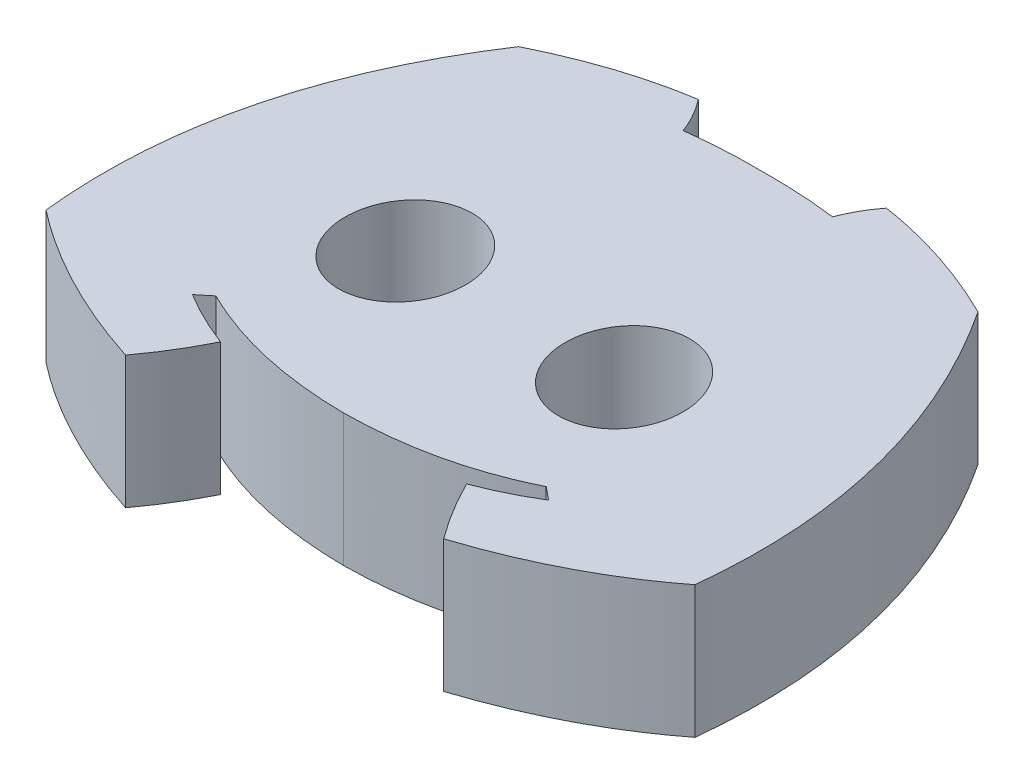
ISO-10303-21;
HEADER;
FILE_DESCRIPTION(('STEP AP214'),'2;1');
FILE_NAME('part.step','',(''),(''),'','','');
FILE_SCHEMA(('AUTOMOTIVE_DESIGN { 1 0 10303 214 1 1 1 1 }'));
ENDSEC;
DATA;
#1=APPLICATION_CONTEXT('core data for automotive mechanical design processes');
#2=APPLICATION_PROTOCOL_DEFINITION('international standard','automotive_design',2000,#1);
#3=PRODUCT_CONTEXT('',#1,'mechanical');
#4=PRODUCT('Part','Part','',(#3));
#5=PRODUCT_RELATED_PRODUCT_CATEGORY('part','',(#4));
#6=PRODUCT_DEFINITION_FORMATION('','',#4);
#7=PRODUCT_DEFINITION_CONTEXT('part definition',#1,'design');
#8=PRODUCT_DEFINITION('design','',#6,#7);
#9=PRODUCT_DEFINITION_SHAPE('','',#8);
#10=(LENGTH_UNIT() NAMED_UNIT(*) SI_UNIT(.MILLI.,.METRE.));
#11=(NAMED_UNIT(*) PLANE_ANGLE_UNIT() SI_UNIT($,.RADIAN.));
#12=(NAMED_UNIT(*) SI_UNIT($,.STERADIAN.) SOLID_ANGLE_UNIT());
#13=UNCERTAINTY_MEASURE_WITH_UNIT(LENGTH_MEASURE(1.E-05),#10,'distance_accuracy_value','');
#14=(GEOMETRIC_REPRESENTATION_CONTEXT(3) GLOBAL_UNCERTAINTY_ASSIGNED_CONTEXT((#13)) GLOBAL_UNIT_ASSIGNED_CONTEXT((#10,
#11,#12)) REPRESENTATION_CONTEXT('',''));
#15=CARTESIAN_POINT('',(0.,0.,0.));
#16=DIRECTION('',(0.,0.,1.));
#17=DIRECTION('',(1.,0.,0.));
#18=AXIS2_PLACEMENT_3D('',#15,#16,#17);
#19=CARTESIAN_POINT('',(8.0825305462773,2.,-2.02160904421695));
#20=CARTESIAN_POINT('',(6.66292776948715,2.,-2.02162384788936));
#21=CARTESIAN_POINT('',(5.52327282169725,2.,-2.58974505584235));
#22=B_SPLINE_CURVE_WITH_KNOTS('',2,(#19,#20,#21),.UNSPECIFIED.,.F.,.F.,(3,3),(0.,1.),.UNSPECIFIED.);
#23=DIRECTION('',(0.,-1.,0.));
#24=VECTOR('',#23,1.);
#25=SURFACE_OF_LINEAR_EXTRUSION('',#22,#24);
#26=CARTESIAN_POINT('',(8.0825305462773,0.,-2.02160904421695));
#27=CARTESIAN_POINT('',(6.66292776948715,0.,-2.02162384788936));
#28=CARTESIAN_POINT('',(5.52327282169725,0.,-2.58974505584235));
#29=B_SPLINE_CURVE_WITH_KNOTS('',2,(#26,#27,#28),.UNSPECIFIED.,.F.,.F.,(3,3),(0.,1.),.UNSPECIFIED.);
#30=CARTESIAN_POINT('',(8.02083951354053,0.,-2.02187905753027));
#31=VERTEX_POINT('',#30);
#32=CARTESIAN_POINT('',(5.52327282169725,0.,-2.58974505584235));
#33=VERTEX_POINT('',#32);
#34=EDGE_CURVE('E395',#31,#33,#29,.T.);
#35=ORIENTED_EDGE('',*,*,#34,.F.);
#36=DIRECTION('',(0.,-1.,0.));
#37=VECTOR('',#36,1.);
#38=CARTESIAN_POINT('',(8.02083951354053,2.,-2.02187905753027));
#39=LINE('',#38,#37);
#40=CARTESIAN_POINT('',(8.02083951354053,2.,-2.02187905753027));
#41=VERTEX_POINT('',#40);
#42=EDGE_CURVE('E11',#41,#31,#39,.T.);
#43=ORIENTED_EDGE('',*,*,#42,.F.);
#44=CARTESIAN_POINT('',(5.52327282169725,2.,-2.58974505584235));
#45=VERTEX_POINT('',#44);
#46=EDGE_CURVE('E360',#41,#45,#22,.T.);
#47=ORIENTED_EDGE('',*,*,#46,.T.);
#48=DIRECTION('',(0.,-1.,0.));
#49=VECTOR('',#48,1.);
#50=CARTESIAN_POINT('',(5.52327282169725,2.,-2.58974505584235));
#51=LINE('',#50,#49);
#52=EDGE_CURVE('E53',#45,#33,#51,.T.);
#53=ORIENTED_EDGE('',*,*,#52,.T.);
#54=EDGE_LOOP('',(#35,#43,#47,#53));
#55=FACE_BOUND('',#54,.T.);
#56=ADVANCED_FACE('F35',(#55),#25,.T.);
#57=CARTESIAN_POINT('',(7.95914845315265,2.,-2.02160904421695));
#58=CARTESIAN_POINT('',(9.3787512299428,2.,-2.02162384788936));
#59=CARTESIAN_POINT('',(10.5184061777327,2.,-2.58974505584235));
#60=B_SPLINE_CURVE_WITH_KNOTS('',2,(#57,#58,#59),.UNSPECIFIED.,.F.,.F.,(3,3),(0.,1.),.UNSPECIFIED.);
#61=DIRECTION('',(0.,-1.,0.));
#62=VECTOR('',#61,1.);
#63=SURFACE_OF_LINEAR_EXTRUSION('',#60,#62);
#64=CARTESIAN_POINT('',(7.95914845315265,0.,-2.02160904421695));
#65=CARTESIAN_POINT('',(9.3787512299428,0.,-2.02162384788936));
#66=CARTESIAN_POINT('',(10.5184061777327,0.,-2.58974505584235));
#67=B_SPLINE_CURVE_WITH_KNOTS('',2,(#64,#65,#66),.UNSPECIFIED.,.F.,.F.,(3,3),(0.,1.),.UNSPECIFIED.);
#68=CARTESIAN_POINT('',(10.5184061777327,0.,-2.58974505584235));
#69=VERTEX_POINT('',#68);
#70=EDGE_CURVE('E393',#31,#69,#67,.T.);
#71=ORIENTED_EDGE('',*,*,#70,.T.);
#72=DIRECTION('',(0.,-1.,0.));
#73=VECTOR('',#72,1.);
#74=CARTESIAN_POINT('',(10.5184061777327,2.,-2.58974505584235));
#75=LINE('',#74,#73);
#76=CARTESIAN_POINT('',(10.5184061777327,2.,-2.58974505584235));
#77=VERTEX_POINT('',#76);
#78=EDGE_CURVE('E45',#77,#69,#75,.T.);
#79=ORIENTED_EDGE('',*,*,#78,.F.);
#80=EDGE_CURVE('E354',#41,#77,#60,.T.);
#81=ORIENTED_EDGE('',*,*,#80,.F.);
#82=ORIENTED_EDGE('',*,*,#42,.T.);
#83=EDGE_LOOP('',(#71,#79,#81,#82));
#84=FACE_BOUND('',#83,.T.);
#85=ADVANCED_FACE('F347',(#84),#63,.F.);
#86=CARTESIAN_POINT('',(5.47717775319327,2.,-6.70674826921623));
#87=DIRECTION('',(0.632534570862425,0.,-0.774532127586641));
#88=DIRECTION('',(-0.774532127586641,0.,-0.632534570862425));
#89=AXIS2_PLACEMENT_3D('',#86,#87,#88);
#90=PLANE('',#89);
#91=DIRECTION('',(0.774532127586641,0.,0.632534570862425));
#92=VECTOR('',#91,1.);
#93=CARTESIAN_POINT('',(5.47717775319327,0.,-6.70674826921623));
#94=LINE('',#93,#92);
#95=CARTESIAN_POINT('',(10.714311063487,0.,-2.42975606580967));
#96=VERTEX_POINT('',#95);
#97=EDGE_CURVE('E391',#69,#96,#94,.T.);
#98=ORIENTED_EDGE('',*,*,#97,.T.);
#99=DIRECTION('',(0.,-1.,0.));
#100=VECTOR('',#99,1.);
#101=CARTESIAN_POINT('',(10.714311063487,2.,-2.42975606580967));
#102=LINE('',#101,#100);
#103=CARTESIAN_POINT('',(10.714311063487,2.,-2.42975606580967));
#104=VERTEX_POINT('',#103);
#105=EDGE_CURVE('E379',#104,#96,#102,.T.);
#106=ORIENTED_EDGE('',*,*,#105,.F.);
#107=DIRECTION('',(0.774532127586641,0.,0.632534570862425));
#108=VECTOR('',#107,1.);
#109=CARTESIAN_POINT('',(5.47717775319327,2.,-6.70674826921623));
#110=LINE('',#109,#108);
#111=EDGE_CURVE('E359',#77,#104,#110,.T.);
#112=ORIENTED_EDGE('',*,*,#111,.F.);
#113=ORIENTED_EDGE('',*,*,#78,.T.);
#114=EDGE_LOOP('',(#98,#106,#112,#113));
#115=FACE_BOUND('',#114,.T.);
#116=ADVANCED_FACE('F343',(#115),#90,.F.);
#117=CARTESIAN_POINT('',(10.714311063487,2.,-2.42975606580967));
#118=CARTESIAN_POINT('',(10.330675491839,2.,-2.19304475564389));
#119=CARTESIAN_POINT('',(9.88171529903122,2.,-2.02160904421695));
#120=B_SPLINE_CURVE_WITH_KNOTS('',2,(#117,#118,#119),.UNSPECIFIED.,.F.,.F.,(3,3),(0.,1.),.UNSPECIFIED.);
#121=DIRECTION('',(0.,-1.,0.));
#122=VECTOR('',#121,1.);
#123=SURFACE_OF_LINEAR_EXTRUSION('',#120,#122);
#124=CARTESIAN_POINT('',(10.714311063487,0.,-2.42975606580967));
#125=CARTESIAN_POINT('',(10.330675491839,0.,-2.19304475564389));
#126=CARTESIAN_POINT('',(9.88171529903122,0.,-2.02160904421695));
#127=B_SPLINE_CURVE_WITH_KNOTS('',2,(#124,#125,#126),.UNSPECIFIED.,.F.,.F.,(3,3),(0.,1.),.UNSPECIFIED.);
#128=CARTESIAN_POINT('',(9.88171529903122,0.,-2.02160904421695));
#129=VERTEX_POINT('',#128);
#130=EDGE_CURVE('E377',#96,#129,#127,.T.);
#131=ORIENTED_EDGE('',*,*,#130,.T.);
#132=DIRECTION('',(0.,-1.,0.));
#133=VECTOR('',#132,1.);
#134=CARTESIAN_POINT('',(9.88171529903122,2.,-2.02160904421695));
#135=LINE('',#134,#133);
#136=CARTESIAN_POINT('',(9.88171529903122,2.,-2.02160904421695));
#137=VERTEX_POINT('',#136);
#138=EDGE_CURVE('E376',#137,#129,#135,.T.);
#139=ORIENTED_EDGE('',*,*,#138,.F.);
#140=EDGE_CURVE('E328',#104,#137,#120,.T.);
#141=ORIENTED_EDGE('',*,*,#140,.F.);
#142=ORIENTED_EDGE('',*,*,#105,.T.);
#143=EDGE_LOOP('',(#131,#139,#141,#142));
#144=FACE_BOUND('',#143,.T.);
#145=ADVANCED_FACE('F339',(#144),#123,.F.);
#146=CARTESIAN_POINT('',(9.88171529903122,2.,-2.02160904421695));
#147=CARTESIAN_POINT('',(10.1225136518505,2.,-1.54002714216466));
#148=CARTESIAN_POINT('',(10.426983897714,2.,-1.1302536569728));
#149=B_SPLINE_CURVE_WITH_KNOTS('',2,(#146,#147,#148),.UNSPECIFIED.,.F.,.F.,(3,3),(0.,1.),.UNSPECIFIED.);
#150=DIRECTION('',(0.,-1.,0.));
#151=VECTOR('',#150,1.);
#152=SURFACE_OF_LINEAR_EXTRUSION('',#149,#151);
#153=CARTESIAN_POINT('',(9.88171529903122,0.,-2.02160904421695));
#154=CARTESIAN_POINT('',(10.1225136518505,0.,-1.54002714216466));
#155=CARTESIAN_POINT('',(10.426983897714,0.,-1.1302536569728));
#156=B_SPLINE_CURVE_WITH_KNOTS('',2,(#153,#154,#155),.UNSPECIFIED.,.F.,.F.,(3,3),(0.,1.),.UNSPECIFIED.);
#157=CARTESIAN_POINT('',(10.426983897714,0.,-1.1302536569728));
#158=VERTEX_POINT('',#157);
#159=EDGE_CURVE('E412',#129,#158,#156,.T.);
#160=ORIENTED_EDGE('',*,*,#159,.T.);
#161=DIRECTION('',(0.,-1.,0.));
#162=VECTOR('',#161,1.);
#163=CARTESIAN_POINT('',(10.426983897714,2.,-1.1302536569728));
#164=LINE('',#163,#162);
#165=CARTESIAN_POINT('',(10.426983897714,2.,-1.1302536569728));
#166=VERTEX_POINT('',#165);
#167=EDGE_CURVE('E380',#166,#158,#164,.T.);
#168=ORIENTED_EDGE('',*,*,#167,.F.);
#169=EDGE_CURVE('E319',#137,#166,#149,.T.);
#170=ORIENTED_EDGE('',*,*,#169,.F.);
#171=ORIENTED_EDGE('',*,*,#138,.T.);
#172=EDGE_LOOP('',(#160,#168,#170,#171));
#173=FACE_BOUND('',#172,.T.);
#174=ADVANCED_FACE('F336',(#173),#152,.F.);
#175=CARTESIAN_POINT('',(10.426983897714,2.,-1.1302536569728));
#176=CARTESIAN_POINT('',(11.8596175561387,2.,-1.59582996070251));
#177=CARTESIAN_POINT('',(12.9296249950977,2.,-2.42975606580967));
#178=B_SPLINE_CURVE_WITH_KNOTS('',2,(#175,#176,#177),.UNSPECIFIED.,.F.,.F.,(3,3),(0.,1.),.UNSPECIFIED.);
#179=DIRECTION('',(0.,-1.,0.));
#180=VECTOR('',#179,1.);
#181=SURFACE_OF_LINEAR_EXTRUSION('',#178,#180);
#182=CARTESIAN_POINT('',(10.426983897714,0.,-1.1302536569728));
#183=CARTESIAN_POINT('',(11.8596175561387,0.,-1.59582996070251));
#184=CARTESIAN_POINT('',(12.9296249950977,0.,-2.42975606580967));
#185=B_SPLINE_CURVE_WITH_KNOTS('',2,(#182,#183,#184),.UNSPECIFIED.,.F.,.F.,(3,3),(0.,1.),.UNSPECIFIED.);
#186=CARTESIAN_POINT('',(12.9296249950977,0.,-2.42975606580967));
#187=VERTEX_POINT('',#186);
#188=EDGE_CURVE('E419',#158,#187,#185,.T.);
#189=ORIENTED_EDGE('',*,*,#188,.T.);
#190=DIRECTION('',(0.,-1.,0.));
#191=VECTOR('',#190,1.);
#192=CARTESIAN_POINT('',(12.9296249950977,2.,-2.42975606580967));
#193=LINE('',#192,#191);
#194=CARTESIAN_POINT('',(12.9296249950977,2.,-2.42975606580967));
#195=VERTEX_POINT('',#194);
#196=EDGE_CURVE('E384',#195,#187,#193,.T.);
#197=ORIENTED_EDGE('',*,*,#196,.F.);
#198=EDGE_CURVE('E310',#166,#195,#178,.T.);
#199=ORIENTED_EDGE('',*,*,#198,.F.);
#200=ORIENTED_EDGE('',*,*,#167,.T.);
#201=EDGE_LOOP('',(#189,#197,#199,#200));
#202=FACE_BOUND('',#201,.T.);
#203=ADVANCED_FACE('F301',(#202),#181,.F.);
#204=CARTESIAN_POINT('',(12.9296249950977,2.,-2.42975606580967));
#205=CARTESIAN_POINT('',(13.2512029248742,2.,-5.47692728961261));
#206=CARTESIAN_POINT('',(11.4952680337632,2.,-8.14405311553062));
#207=B_SPLINE_CURVE_WITH_KNOTS('',2,(#204,#205,#206),.UNSPECIFIED.,.F.,.F.,(3,3),(0.,1.),.UNSPECIFIED.);
#208=DIRECTION('',(0.,-1.,0.));
#209=VECTOR('',#208,1.);
#210=SURFACE_OF_LINEAR_EXTRUSION('',#207,#209);
#211=CARTESIAN_POINT('',(12.9296249950977,0.,-2.42975606580967));
#212=CARTESIAN_POINT('',(13.2512029248742,0.,-5.47692728961261));
#213=CARTESIAN_POINT('',(11.4952680337632,0.,-8.14405311553062));
#214=B_SPLINE_CURVE_WITH_KNOTS('',2,(#211,#212,#213),.UNSPECIFIED.,.F.,.F.,(3,3),(0.,1.),.UNSPECIFIED.);
#215=CARTESIAN_POINT('',(11.4952680337632,0.,-8.14405311553062));
#216=VERTEX_POINT('',#215);
#217=EDGE_CURVE('E427',#187,#216,#214,.T.);
#218=ORIENTED_EDGE('',*,*,#217,.T.);
#219=DIRECTION('',(0.,-1.,0.));
#220=VECTOR('',#219,1.);
#221=CARTESIAN_POINT('',(11.4952680337632,2.,-8.14405311553062));
#222=LINE('',#221,#220);
#223=CARTESIAN_POINT('',(11.4952680337632,2.,-8.14405311553062));
#224=VERTEX_POINT('',#223);
#225=EDGE_CURVE('E538',#224,#216,#222,.T.);
#226=ORIENTED_EDGE('',*,*,#225,.F.);
#227=EDGE_CURVE('E305',#195,#224,#207,.T.);
#228=ORIENTED_EDGE('',*,*,#227,.F.);
#229=ORIENTED_EDGE('',*,*,#196,.T.);
#230=EDGE_LOOP('',(#218,#226,#228,#229));
#231=FACE_BOUND('',#230,.T.);
#232=ADVANCED_FACE('F297',(#231),#210,.F.);
#233=CARTESIAN_POINT('',(11.4952680337632,2.,-8.14405311553062));
#234=CARTESIAN_POINT('',(10.4597892532342,2.,-8.65695680948746));
#235=CARTESIAN_POINT('',(9.44313329287997,2.,-8.8095420724418));
#236=B_SPLINE_CURVE_WITH_KNOTS('',2,(#233,#234,#235),.UNSPECIFIED.,.F.,.F.,(3,3),(0.,1.),.UNSPECIFIED.);
#237=DIRECTION('',(0.,-1.,0.));
#238=VECTOR('',#237,1.);
#239=SURFACE_OF_LINEAR_EXTRUSION('',#236,#238);
#240=CARTESIAN_POINT('',(11.4952680337632,0.,-8.14405311553062));
#241=CARTESIAN_POINT('',(10.4597892532342,0.,-8.65695680948746));
#242=CARTESIAN_POINT('',(9.44313329287997,0.,-8.8095420724418));
#243=B_SPLINE_CURVE_WITH_KNOTS('',2,(#240,#241,#242),.UNSPECIFIED.,.F.,.F.,(3,3),(0.,1.),.UNSPECIFIED.);
#244=CARTESIAN_POINT('',(9.44313329287997,0.,-8.8095420724418));
#245=VERTEX_POINT('',#244);
#246=EDGE_CURVE('E435',#216,#245,#243,.T.);
#247=ORIENTED_EDGE('',*,*,#246,.T.);
#248=DIRECTION('',(0.,-1.,0.));
#249=VECTOR('',#248,1.);
#250=CARTESIAN_POINT('',(9.44313329287997,2.,-8.8095420724418));
#251=LINE('',#250,#249);
#252=CARTESIAN_POINT('',(9.44313329287997,2.,-8.8095420724418));
#253=VERTEX_POINT('',#252);
#254=EDGE_CURVE('E535',#253,#245,#251,.T.);
#255=ORIENTED_EDGE('',*,*,#254,.F.);
#256=EDGE_CURVE('E282',#224,#253,#236,.T.);
#257=ORIENTED_EDGE('',*,*,#256,.F.);
#258=ORIENTED_EDGE('',*,*,#225,.T.);
#259=EDGE_LOOP('',(#247,#255,#257,#258));
#260=FACE_BOUND('',#259,.T.);
#261=ADVANCED_FACE('F293',(#260),#239,.F.);
#262=CARTESIAN_POINT('',(9.44313329287997,2.,-8.8095420724418));
#263=CARTESIAN_POINT('',(9.25790390004631,2.,-8.57556810254666));
#264=CARTESIAN_POINT('',(9.15151648588631,2.,-8.28879777423884));
#265=B_SPLINE_CURVE_WITH_KNOTS('',2,(#262,#263,#264),.UNSPECIFIED.,.F.,.F.,(3,3),(0.,1.),.UNSPECIFIED.);
#266=DIRECTION('',(0.,-1.,0.));
#267=VECTOR('',#266,1.);
#268=SURFACE_OF_LINEAR_EXTRUSION('',#265,#267);
#269=CARTESIAN_POINT('',(9.44313329287997,0.,-8.8095420724418));
#270=CARTESIAN_POINT('',(9.25790390004631,0.,-8.57556810254666));
#271=CARTESIAN_POINT('',(9.15151648588631,0.,-8.28879777423884));
#272=B_SPLINE_CURVE_WITH_KNOTS('',2,(#269,#270,#271),.UNSPECIFIED.,.F.,.F.,(3,3),(0.,1.),.UNSPECIFIED.);
#273=CARTESIAN_POINT('',(9.15151648588631,0.,-8.28879777423884));
#274=VERTEX_POINT('',#273);
#275=EDGE_CURVE('E443',#245,#274,#272,.T.);
#276=ORIENTED_EDGE('',*,*,#275,.T.);
#277=DIRECTION('',(0.,-1.,0.));
#278=VECTOR('',#277,1.);
#279=CARTESIAN_POINT('',(9.15151648588631,2.,-8.28879777423884));
#280=LINE('',#279,#278);
#281=CARTESIAN_POINT('',(9.15151648588631,2.,-8.28879777423884));
#282=VERTEX_POINT('',#281);
#283=EDGE_CURVE('E532',#282,#274,#280,.T.);
#284=ORIENTED_EDGE('',*,*,#283,.F.);
#285=EDGE_CURVE('E273',#253,#282,#265,.T.);
#286=ORIENTED_EDGE('',*,*,#285,.F.);
#287=ORIENTED_EDGE('',*,*,#254,.T.);
#288=EDGE_LOOP('',(#276,#284,#286,#287));
#289=FACE_BOUND('',#288,.T.);
#290=ADVANCED_FACE('F290',(#289),#268,.F.);
#291=CARTESIAN_POINT('',(9.15151648588631,2.,-8.28879777423884));
#292=CARTESIAN_POINT('',(8.58697190628316,2.,-8.360115376634));
#293=CARTESIAN_POINT('',(8.02083949971497,2.,-8.35128709002319));
#294=B_SPLINE_CURVE_WITH_KNOTS('',2,(#291,#292,#293),.UNSPECIFIED.,.F.,.F.,(3,3),(0.,1.),.UNSPECIFIED.);
#295=DIRECTION('',(0.,-1.,0.));
#296=VECTOR('',#295,1.);
#297=SURFACE_OF_LINEAR_EXTRUSION('',#294,#296);
#298=CARTESIAN_POINT('',(9.15151648588631,0.,-8.28879777423884));
#299=CARTESIAN_POINT('',(8.58697190628316,0.,-8.360115376634));
#300=CARTESIAN_POINT('',(8.02083949971497,0.,-8.35128709002319));
#301=B_SPLINE_CURVE_WITH_KNOTS('',2,(#298,#299,#300),.UNSPECIFIED.,.F.,.F.,(3,3),(0.,1.),.UNSPECIFIED.);
#302=CARTESIAN_POINT('',(8.02083949971497,0.,-8.35128709002319));
#303=VERTEX_POINT('',#302);
#304=EDGE_CURVE('E451',#274,#303,#301,.T.);
#305=ORIENTED_EDGE('',*,*,#304,.T.);
#306=DIRECTION('',(0.,-1.,0.));
#307=VECTOR('',#306,1.);
#308=CARTESIAN_POINT('',(8.02083949971497,2.,-8.35128709002319));
#309=LINE('',#308,#307);
#310=CARTESIAN_POINT('',(8.02083949971497,2.,-8.35128709002319));
#311=VERTEX_POINT('',#310);
#312=EDGE_CURVE('E530',#311,#303,#309,.T.);
#313=ORIENTED_EDGE('',*,*,#312,.F.);
#314=EDGE_CURVE('E265',#282,#311,#294,.T.);
#315=ORIENTED_EDGE('',*,*,#314,.F.);
#316=ORIENTED_EDGE('',*,*,#283,.T.);
#317=EDGE_LOOP('',(#305,#313,#315,#316));
#318=FACE_BOUND('',#317,.T.);
#319=ADVANCED_FACE('F256',(#318),#297,.F.);
#320=CARTESIAN_POINT('',(6.89016251354364,2.,-8.28879777423884));
#321=CARTESIAN_POINT('',(7.45470709314679,2.,-8.360115376634));
#322=CARTESIAN_POINT('',(8.02083949971497,2.,-8.35128709002319));
#323=B_SPLINE_CURVE_WITH_KNOTS('',2,(#320,#321,#322),.UNSPECIFIED.,.F.,.F.,(3,3),(0.,1.),.UNSPECIFIED.);
#324=DIRECTION('',(0.,-1.,0.));
#325=VECTOR('',#324,1.);
#326=SURFACE_OF_LINEAR_EXTRUSION('',#323,#325);
#327=CARTESIAN_POINT('',(6.89016251354364,0.,-8.28879777423884));
#328=CARTESIAN_POINT('',(7.45470709314679,0.,-8.360115376634));
#329=CARTESIAN_POINT('',(8.02083949971497,0.,-8.35128709002319));
#330=B_SPLINE_CURVE_WITH_KNOTS('',2,(#327,#328,#329),.UNSPECIFIED.,.F.,.F.,(3,3),(0.,1.),.UNSPECIFIED.);
#331=CARTESIAN_POINT('',(6.89016251354364,0.,-8.28879777423884));
#332=VERTEX_POINT('',#331);
#333=EDGE_CURVE('E459',#332,#303,#330,.T.);
#334=ORIENTED_EDGE('',*,*,#333,.F.);
#335=DIRECTION('',(0.,-1.,0.));
#336=VECTOR('',#335,1.);
#337=CARTESIAN_POINT('',(6.89016251354364,2.,-8.28879777423884));
#338=LINE('',#337,#336);
#339=CARTESIAN_POINT('',(6.89016251354364,2.,-8.28879777423884));
#340=VERTEX_POINT('',#339);
#341=EDGE_CURVE('E528',#340,#332,#338,.T.);
#342=ORIENTED_EDGE('',*,*,#341,.F.);
#343=EDGE_CURVE('E260',#340,#311,#323,.T.);
#344=ORIENTED_EDGE('',*,*,#343,.T.);
#345=ORIENTED_EDGE('',*,*,#312,.T.);
#346=EDGE_LOOP('',(#334,#342,#344,#345));
#347=FACE_BOUND('',#346,.T.);
#348=ADVANCED_FACE('F252',(#347),#326,.T.);
#349=CARTESIAN_POINT('',(6.59854570654998,2.,-8.8095420724418));
#350=CARTESIAN_POINT('',(6.78377509938364,2.,-8.57556810254666));
#351=CARTESIAN_POINT('',(6.89016251354364,2.,-8.28879777423884));
#352=B_SPLINE_CURVE_WITH_KNOTS('',2,(#349,#350,#351),.UNSPECIFIED.,.F.,.F.,(3,3),(0.,1.),.UNSPECIFIED.);
#353=DIRECTION('',(0.,-1.,0.));
#354=VECTOR('',#353,1.);
#355=SURFACE_OF_LINEAR_EXTRUSION('',#352,#354);
#356=CARTESIAN_POINT('',(6.59854570654998,0.,-8.8095420724418));
#357=CARTESIAN_POINT('',(6.78377509938364,0.,-8.57556810254666));
#358=CARTESIAN_POINT('',(6.89016251354364,0.,-8.28879777423884));
#359=B_SPLINE_CURVE_WITH_KNOTS('',2,(#356,#357,#358),.UNSPECIFIED.,.F.,.F.,(3,3),(0.,1.),.UNSPECIFIED.);
#360=CARTESIAN_POINT('',(6.59854570654998,0.,-8.8095420724418));
#361=VERTEX_POINT('',#360);
#362=EDGE_CURVE('E467',#361,#332,#359,.T.);
#363=ORIENTED_EDGE('',*,*,#362,.F.);
#364=DIRECTION('',(0.,-1.,0.));
#365=VECTOR('',#364,1.);
#366=CARTESIAN_POINT('',(6.59854570654998,2.,-8.8095420724418));
#367=LINE('',#366,#365);
#368=CARTESIAN_POINT('',(6.59854570654998,2.,-8.8095420724418));
#369=VERTEX_POINT('',#368);
#370=EDGE_CURVE('E526',#369,#361,#367,.T.);
#371=ORIENTED_EDGE('',*,*,#370,.F.);
#372=EDGE_CURVE('E237',#369,#340,#352,.T.);
#373=ORIENTED_EDGE('',*,*,#372,.T.);
#374=ORIENTED_EDGE('',*,*,#341,.T.);
#375=EDGE_LOOP('',(#363,#371,#373,#374));
#376=FACE_BOUND('',#375,.T.);
#377=ADVANCED_FACE('F248',(#376),#355,.T.);
#378=CARTESIAN_POINT('',(4.54641096566675,2.,-8.14405311553062));
#379=CARTESIAN_POINT('',(5.58188974619578,2.,-8.65695680948746));
#380=CARTESIAN_POINT('',(6.59854570654998,2.,-8.8095420724418));
#381=B_SPLINE_CURVE_WITH_KNOTS('',2,(#378,#379,#380),.UNSPECIFIED.,.F.,.F.,(3,3),(0.,1.),.UNSPECIFIED.);
#382=DIRECTION('',(0.,-1.,0.));
#383=VECTOR('',#382,1.);
#384=SURFACE_OF_LINEAR_EXTRUSION('',#381,#383);
#385=CARTESIAN_POINT('',(4.54641096566675,0.,-8.14405311553062));
#386=CARTESIAN_POINT('',(5.58188974619578,0.,-8.65695680948746));
#387=CARTESIAN_POINT('',(6.59854570654998,0.,-8.8095420724418));
#388=B_SPLINE_CURVE_WITH_KNOTS('',2,(#385,#386,#387),.UNSPECIFIED.,.F.,.F.,(3,3),(0.,1.),.UNSPECIFIED.);
#389=CARTESIAN_POINT('',(4.54641096566675,0.,-8.14405311553062));
#390=VERTEX_POINT('',#389);
#391=EDGE_CURVE('E475',#390,#361,#388,.T.);
#392=ORIENTED_EDGE('',*,*,#391,.F.);
#393=DIRECTION('',(0.,-1.,0.));
#394=VECTOR('',#393,1.);
#395=CARTESIAN_POINT('',(4.54641096566675,2.,-8.14405311553062));
#396=LINE('',#395,#394);
#397=CARTESIAN_POINT('',(4.54641096566675,2.,-8.14405311553062));
#398=VERTEX_POINT('',#397);
#399=EDGE_CURVE('E524',#398,#390,#396,.T.);
#400=ORIENTED_EDGE('',*,*,#399,.F.);
#401=EDGE_CURVE('E228',#398,#369,#381,.T.);
#402=ORIENTED_EDGE('',*,*,#401,.T.);
#403=ORIENTED_EDGE('',*,*,#370,.T.);
#404=EDGE_LOOP('',(#392,#400,#402,#403));
#405=FACE_BOUND('',#404,.T.);
#406=ADVANCED_FACE('F245',(#405),#384,.T.);
#407=CARTESIAN_POINT('',(3.11205400433227,2.,-2.42975606580967));
#408=CARTESIAN_POINT('',(2.79047607455571,2.,-5.47692728961261));
#409=CARTESIAN_POINT('',(4.54641096566675,2.,-8.14405311553062));
#410=B_SPLINE_CURVE_WITH_KNOTS('',2,(#407,#408,#409),.UNSPECIFIED.,.F.,.F.,(3,3),(0.,1.),.UNSPECIFIED.);
#411=DIRECTION('',(0.,-1.,0.));
#412=VECTOR('',#411,1.);
#413=SURFACE_OF_LINEAR_EXTRUSION('',#410,#412);
#414=CARTESIAN_POINT('',(3.11205400433227,0.,-2.42975606580967));
#415=CARTESIAN_POINT('',(2.79047607455571,0.,-5.47692728961261));
#416=CARTESIAN_POINT('',(4.54641096566675,0.,-8.14405311553062));
#417=B_SPLINE_CURVE_WITH_KNOTS('',2,(#414,#415,#416),.UNSPECIFIED.,.F.,.F.,(3,3),(0.,1.),.UNSPECIFIED.);
#418=CARTESIAN_POINT('',(3.11205400433227,0.,-2.42975606580967));
#419=VERTEX_POINT('',#418);
#420=EDGE_CURVE('E483',#419,#390,#417,.T.);
#421=ORIENTED_EDGE('',*,*,#420,.F.);
#422=DIRECTION('',(0.,-1.,0.));
#423=VECTOR('',#422,1.);
#424=CARTESIAN_POINT('',(3.11205400433227,2.,-2.42975606580967));
#425=LINE('',#424,#423);
#426=CARTESIAN_POINT('',(3.11205400433227,2.,-2.42975606580967));
#427=VERTEX_POINT('',#426);
#428=EDGE_CURVE('E522',#427,#419,#425,.T.);
#429=ORIENTED_EDGE('',*,*,#428,.F.);
#430=EDGE_CURVE('E219',#427,#398,#410,.T.);
#431=ORIENTED_EDGE('',*,*,#430,.T.);
#432=ORIENTED_EDGE('',*,*,#399,.T.);
#433=EDGE_LOOP('',(#421,#429,#431,#432));
#434=FACE_BOUND('',#433,.T.);
#435=ADVANCED_FACE('F212',(#434),#413,.T.);
#436=CARTESIAN_POINT('',(5.61469510171592,2.,-1.1302536569728));
#437=CARTESIAN_POINT('',(4.18206144329125,2.,-1.59582996070251));
#438=CARTESIAN_POINT('',(3.11205400433227,2.,-2.42975606580967));
#439=B_SPLINE_CURVE_WITH_KNOTS('',2,(#436,#437,#438),.UNSPECIFIED.,.F.,.F.,(3,3),(0.,1.),.UNSPECIFIED.);
#440=DIRECTION('',(0.,-1.,0.));
#441=VECTOR('',#440,1.);
#442=SURFACE_OF_LINEAR_EXTRUSION('',#439,#441);
#443=CARTESIAN_POINT('',(5.61469510171592,0.,-1.1302536569728));
#444=CARTESIAN_POINT('',(4.18206144329125,0.,-1.59582996070251));
#445=CARTESIAN_POINT('',(3.11205400433227,0.,-2.42975606580967));
#446=B_SPLINE_CURVE_WITH_KNOTS('',2,(#443,#444,#445),.UNSPECIFIED.,.F.,.F.,(3,3),(0.,1.),.UNSPECIFIED.);
#447=CARTESIAN_POINT('',(5.61469510171592,0.,-1.1302536569728));
#448=VERTEX_POINT('',#447);
#449=EDGE_CURVE('E491',#448,#419,#446,.T.);
#450=ORIENTED_EDGE('',*,*,#449,.F.);
#451=DIRECTION('',(0.,-1.,0.));
#452=VECTOR('',#451,1.);
#453=CARTESIAN_POINT('',(5.61469510171592,2.,-1.1302536569728));
#454=LINE('',#453,#452);
#455=CARTESIAN_POINT('',(5.61469510171592,2.,-1.1302536569728));
#456=VERTEX_POINT('',#455);
#457=EDGE_CURVE('E172',#456,#448,#454,.T.);
#458=ORIENTED_EDGE('',*,*,#457,.F.);
#459=EDGE_CURVE('E183',#456,#427,#439,.T.);
#460=ORIENTED_EDGE('',*,*,#459,.T.);
#461=ORIENTED_EDGE('',*,*,#428,.T.);
#462=EDGE_LOOP('',(#450,#458,#460,#461));
#463=FACE_BOUND('',#462,.T.);
#464=ADVANCED_FACE('F209',(#463),#442,.T.);
#465=CARTESIAN_POINT('',(6.15996370039873,2.,-2.02160904421695));
#466=CARTESIAN_POINT('',(5.9191653475795,2.,-1.54002714216466));
#467=CARTESIAN_POINT('',(5.61469510171592,2.,-1.1302536569728));
#468=B_SPLINE_CURVE_WITH_KNOTS('',2,(#465,#466,#467),.UNSPECIFIED.,.F.,.F.,(3,3),(0.,1.),.UNSPECIFIED.);
#469=DIRECTION('',(0.,-1.,0.));
#470=VECTOR('',#469,1.);
#471=SURFACE_OF_LINEAR_EXTRUSION('',#468,#470);
#472=CARTESIAN_POINT('',(6.15996370039873,0.,-2.02160904421695));
#473=CARTESIAN_POINT('',(5.9191653475795,0.,-1.54002714216466));
#474=CARTESIAN_POINT('',(5.61469510171592,0.,-1.1302536569728));
#475=B_SPLINE_CURVE_WITH_KNOTS('',2,(#472,#473,#474),.UNSPECIFIED.,.F.,.F.,(3,3),(0.,1.),.UNSPECIFIED.);
#476=CARTESIAN_POINT('',(6.15996370039873,0.,-2.02160904421695));
#477=VERTEX_POINT('',#476);
#478=EDGE_CURVE('E168',#477,#448,#475,.T.);
#479=ORIENTED_EDGE('',*,*,#478,.F.);
#480=DIRECTION('',(0.,-1.,0.));
#481=VECTOR('',#480,1.);
#482=CARTESIAN_POINT('',(6.15996370039873,2.,-2.02160904421695));
#483=LINE('',#482,#481);
#484=CARTESIAN_POINT('',(6.15996370039873,2.,-2.02160904421695));
#485=VERTEX_POINT('',#484);
#486=EDGE_CURVE('E163',#485,#477,#483,.T.);
#487=ORIENTED_EDGE('',*,*,#486,.F.);
#488=EDGE_CURVE('E166',#485,#456,#468,.T.);
#489=ORIENTED_EDGE('',*,*,#488,.T.);
#490=ORIENTED_EDGE('',*,*,#457,.T.);
#491=EDGE_LOOP('',(#479,#487,#489,#490));
#492=FACE_BOUND('',#491,.T.);
#493=ADVANCED_FACE('F165',(#492),#471,.T.);
#494=CARTESIAN_POINT('',(5.32736793594295,2.,-2.42975606580967));
#495=CARTESIAN_POINT('',(5.71100350759094,2.,-2.19304475564389));
#496=CARTESIAN_POINT('',(6.15996370039873,2.,-2.02160904421695));
#497=B_SPLINE_CURVE_WITH_KNOTS('',2,(#494,#495,#496),.UNSPECIFIED.,.F.,.F.,(3,3),(0.,1.),.UNSPECIFIED.);
#498=DIRECTION('',(0.,-1.,0.));
#499=VECTOR('',#498,1.);
#500=SURFACE_OF_LINEAR_EXTRUSION('',#497,#499);
#501=CARTESIAN_POINT('',(5.32736793594295,0.,-2.42975606580967));
#502=CARTESIAN_POINT('',(5.71100350759094,0.,-2.19304475564389));
#503=CARTESIAN_POINT('',(6.15996370039873,0.,-2.02160904421695));
#504=B_SPLINE_CURVE_WITH_KNOTS('',2,(#501,#502,#503),.UNSPECIFIED.,.F.,.F.,(3,3),(0.,1.),.UNSPECIFIED.);
#505=CARTESIAN_POINT('',(5.32736793594295,0.,-2.42975606580967));
#506=VERTEX_POINT('',#505);
#507=EDGE_CURVE('E505',#506,#477,#504,.T.);
#508=ORIENTED_EDGE('',*,*,#507,.F.);
#509=DIRECTION('',(0.,-1.,0.));
#510=VECTOR('',#509,1.);
#511=CARTESIAN_POINT('',(5.32736793594295,2.,-2.42975606580967));
#512=LINE('',#511,#510);
#513=CARTESIAN_POINT('',(5.32736793594295,2.,-2.42975606580967));
#514=VERTEX_POINT('',#513);
#515=EDGE_CURVE('E108',#514,#506,#512,.T.);
#516=ORIENTED_EDGE('',*,*,#515,.F.);
#517=EDGE_CURVE('E180',#514,#485,#497,.T.);
#518=ORIENTED_EDGE('',*,*,#517,.T.);
#519=ORIENTED_EDGE('',*,*,#486,.T.);
#520=EDGE_LOOP('',(#508,#516,#518,#519));
#521=FACE_BOUND('',#520,.T.);
#522=ADVANCED_FACE('F185',(#521),#500,.T.);
#523=CARTESIAN_POINT('',(6.36647690309777,2.,-4.61043718375752));
#524=DIRECTION('',(0.,1.,0.));
#525=DIRECTION('',(0.0455956835516731,0.,-0.998959975995763));
#526=AXIS2_PLACEMENT_3D('',#523,#524,#525);
#527=ELLIPSE('',#526,1.00176292456456,0.900385246380213);
#528=DIRECTION('',(0.,-1.,0.));
#529=VECTOR('',#528,1.);
#530=SURFACE_OF_LINEAR_EXTRUSION('',#527,#529);
#531=CARTESIAN_POINT('',(6.41215296840001,2.,-5.61115825083398));
#532=VERTEX_POINT('',#531);
#533=EDGE_CURVE('E715',#532,#532,#527,.T.);
#534=ORIENTED_EDGE('',*,*,#533,.T.);
#535=EDGE_LOOP('',(#534));
#536=FACE_BOUND('',#535,.T.);
#537=CARTESIAN_POINT('',(6.36647690309777,0.,-4.61043718375752));
#538=DIRECTION('',(0.,1.,0.));
#539=DIRECTION('',(0.0455956835516731,0.,-0.998959975995763));
#540=AXIS2_PLACEMENT_3D('',#537,#538,#539);
#541=ELLIPSE('',#540,1.00176292456456,0.900385246380213);
#542=CARTESIAN_POINT('',(6.41215296840001,0.,-5.61115825083398));
#543=VERTEX_POINT('',#542);
#544=EDGE_CURVE('E398',#543,#543,#541,.T.);
#545=ORIENTED_EDGE('',*,*,#544,.F.);
#546=EDGE_LOOP('',(#545));
#547=FACE_BOUND('',#546,.T.);
#548=ADVANCED_FACE('F204',(#536,#547),#530,.T.);
#549=CARTESIAN_POINT('',(9.67520209633218,2.,-4.61043718375752));
#550=DIRECTION('',(0.,-1.,0.));
#551=DIRECTION('',(-0.0455956835516731,0.,-0.998959975995763));
#552=AXIS2_PLACEMENT_3D('',#549,#550,#551);
#553=ELLIPSE('',#552,1.00176292456456,0.900385246380213);
#554=DIRECTION('',(0.,-1.,0.));
#555=VECTOR('',#554,1.);
#556=SURFACE_OF_LINEAR_EXTRUSION('',#553,#555);
#557=CARTESIAN_POINT('',(9.62952603102994,2.,-5.61115825083398));
#558=VERTEX_POINT('',#557);
#559=EDGE_CURVE('E518',#558,#558,#553,.T.);
#560=ORIENTED_EDGE('',*,*,#559,.F.);
#561=EDGE_LOOP('',(#560));
#562=FACE_BOUND('',#561,.T.);
#563=CARTESIAN_POINT('',(9.67520209633218,0.,-4.61043718375752));
#564=DIRECTION('',(0.,-1.,0.));
#565=DIRECTION('',(-0.0455956835516731,0.,-0.998959975995763));
#566=AXIS2_PLACEMENT_3D('',#563,#564,#565);
#567=ELLIPSE('',#566,1.00176292456456,0.900385246380213);
#568=CARTESIAN_POINT('',(9.62952603102994,0.,-5.61115825083398));
#569=VERTEX_POINT('',#568);
#570=EDGE_CURVE('E673',#569,#569,#567,.T.);
#571=ORIENTED_EDGE('',*,*,#570,.T.);
#572=EDGE_LOOP('',(#571));
#573=FACE_BOUND('',#572,.T.);
#574=ADVANCED_FACE('F37',(#562,#573),#556,.F.);
#575=CARTESIAN_POINT('',(0.941097747161909,2.,1.15236458836152));
#576=DIRECTION('',(0.632534570862425,0.,0.774532127586641));
#577=DIRECTION('',(0.774532127586641,0.,-0.632534570862425));
#578=AXIS2_PLACEMENT_3D('',#575,#576,#577);
#579=PLANE('',#578);
#580=DIRECTION('',(-0.774532127586641,0.,0.632534570862425));
#581=VECTOR('',#580,1.);
#582=CARTESIAN_POINT('',(0.941097747161909,0.,1.15236458836152));
#583=LINE('',#582,#581);
#584=EDGE_CURVE('E512',#33,#506,#583,.T.);
#585=ORIENTED_EDGE('',*,*,#584,.F.);
#586=ORIENTED_EDGE('',*,*,#52,.F.);
#587=DIRECTION('',(-0.774532127586641,0.,0.632534570862425));
#588=VECTOR('',#587,1.);
#589=CARTESIAN_POINT('',(0.941097747161909,2.,1.15236458836152));
#590=LINE('',#589,#588);
#591=EDGE_CURVE('E186',#45,#514,#590,.T.);
#592=ORIENTED_EDGE('',*,*,#591,.T.);
#593=ORIENTED_EDGE('',*,*,#515,.T.);
#594=EDGE_LOOP('',(#585,#586,#592,#593));
#595=FACE_BOUND('',#594,.T.);
#596=ADVANCED_FACE('F205',(#595),#579,.T.);
#597=CARTESIAN_POINT('',(0.,2.,0.));
#598=DIRECTION('',(0.,1.,0.));
#599=DIRECTION('',(0.,0.,1.));
#600=AXIS2_PLACEMENT_3D('',#597,#598,#599);
#601=PLANE('',#600);
#602=ORIENTED_EDGE('',*,*,#559,.T.);
#603=EDGE_LOOP('',(#602));
#604=FACE_BOUND('',#603,.T.);
#605=ORIENTED_EDGE('',*,*,#533,.F.);
#606=EDGE_LOOP('',(#605));
#607=FACE_BOUND('',#606,.T.);
#608=ORIENTED_EDGE('',*,*,#46,.F.);
#609=ORIENTED_EDGE('',*,*,#80,.T.);
#610=ORIENTED_EDGE('',*,*,#111,.T.);
#611=ORIENTED_EDGE('',*,*,#140,.T.);
#612=ORIENTED_EDGE('',*,*,#169,.T.);
#613=ORIENTED_EDGE('',*,*,#198,.T.);
#614=ORIENTED_EDGE('',*,*,#227,.T.);
#615=ORIENTED_EDGE('',*,*,#256,.T.);
#616=ORIENTED_EDGE('',*,*,#285,.T.);
#617=ORIENTED_EDGE('',*,*,#314,.T.);
#618=ORIENTED_EDGE('',*,*,#343,.F.);
#619=ORIENTED_EDGE('',*,*,#372,.F.);
#620=ORIENTED_EDGE('',*,*,#401,.F.);
#621=ORIENTED_EDGE('',*,*,#430,.F.);
#622=ORIENTED_EDGE('',*,*,#459,.F.);
#623=ORIENTED_EDGE('',*,*,#488,.F.);
#624=ORIENTED_EDGE('',*,*,#517,.F.);
#625=ORIENTED_EDGE('',*,*,#591,.F.);
#626=EDGE_LOOP('',(#608,#609,#610,#611,#612,#613,#614,#615,#616,#617,#618,#619,#620,#621,#622,
#623,#624,#625));
#627=FACE_BOUND('',#626,.T.);
#628=ADVANCED_FACE('F178',(#604,#607,#627),#601,.T.);
#629=CARTESIAN_POINT('',(0.,0.,0.));
#630=DIRECTION('',(0.,1.,0.));
#631=DIRECTION('',(0.,0.,1.));
#632=AXIS2_PLACEMENT_3D('',#629,#630,#631);
#633=PLANE('',#632);
#634=ORIENTED_EDGE('',*,*,#570,.F.);
#635=EDGE_LOOP('',(#634));
#636=FACE_BOUND('',#635,.T.);
#637=ORIENTED_EDGE('',*,*,#544,.T.);
#638=EDGE_LOOP('',(#637));
#639=FACE_BOUND('',#638,.T.);
#640=ORIENTED_EDGE('',*,*,#34,.T.);
#641=ORIENTED_EDGE('',*,*,#584,.T.);
#642=ORIENTED_EDGE('',*,*,#507,.T.);
#643=ORIENTED_EDGE('',*,*,#478,.T.);
#644=ORIENTED_EDGE('',*,*,#449,.T.);
#645=ORIENTED_EDGE('',*,*,#420,.T.);
#646=ORIENTED_EDGE('',*,*,#391,.T.);
#647=ORIENTED_EDGE('',*,*,#362,.T.);
#648=ORIENTED_EDGE('',*,*,#333,.T.);
#649=ORIENTED_EDGE('',*,*,#304,.F.);
#650=ORIENTED_EDGE('',*,*,#275,.F.);
#651=ORIENTED_EDGE('',*,*,#246,.F.);
#652=ORIENTED_EDGE('',*,*,#217,.F.);
#653=ORIENTED_EDGE('',*,*,#188,.F.);
#654=ORIENTED_EDGE('',*,*,#159,.F.);
#655=ORIENTED_EDGE('',*,*,#130,.F.);
#656=ORIENTED_EDGE('',*,*,#97,.F.);
#657=ORIENTED_EDGE('',*,*,#70,.F.);
#658=EDGE_LOOP('',(#640,#641,#642,#643,#644,#645,#646,#647,#648,#649,#650,#651,#652,#653,#654,
#655,#656,#657));
#659=FACE_BOUND('',#658,.T.);
#660=ADVANCED_FACE('F544',(#636,#639,#659),#633,.F.);
#661=CLOSED_SHELL('',(#56,#85,#116,#145,#174,#203,#232,#261,#290,#319,#348,#377,#406,#435,#464,
#493,#522,#548,#574,#596,#628,#660));
#662=MANIFOLD_SOLID_BREP('B2',#661);
#663=ADVANCED_BREP_SHAPE_REPRESENTATION('',(#18,#662),#14);
#664=SHAPE_DEFINITION_REPRESENTATION(#9,#663);
ENDSEC;
END-ISO-10303-21;
